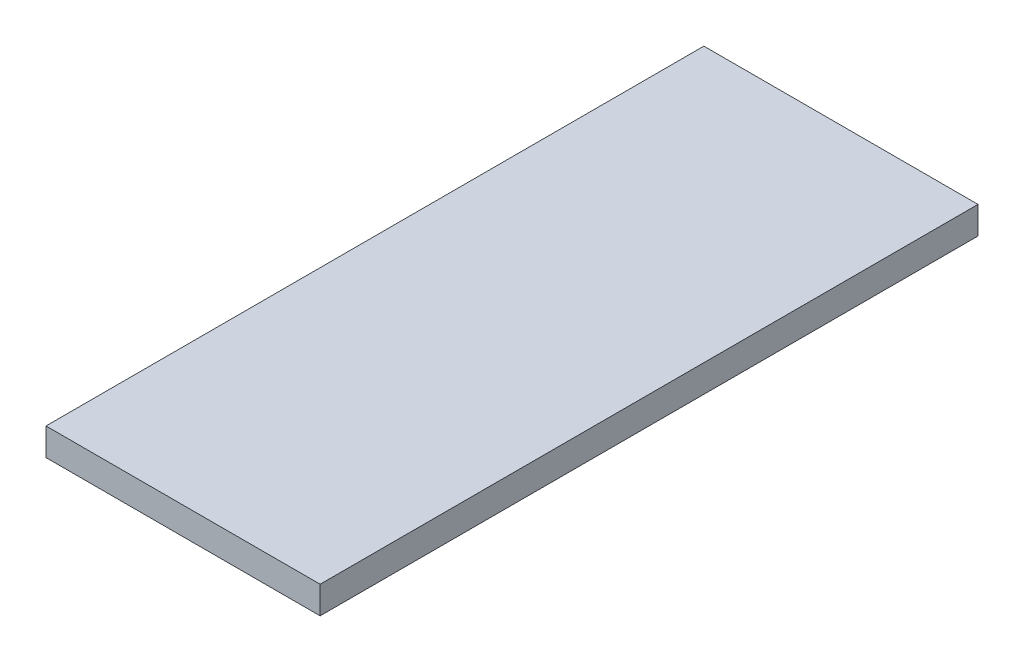
ISO-10303-21;
HEADER;
FILE_DESCRIPTION(('STEP AP214'),'2;1');
FILE_NAME('part.step','',(''),(''),'','','');
FILE_SCHEMA(('AUTOMOTIVE_DESIGN { 1 0 10303 214 1 1 1 1 }'));
ENDSEC;
DATA;
#1=APPLICATION_CONTEXT('core data for automotive mechanical design processes');
#2=APPLICATION_PROTOCOL_DEFINITION('international standard','automotive_design',2000,#1);
#3=PRODUCT_CONTEXT('',#1,'mechanical');
#4=PRODUCT('Part','Part','',(#3));
#5=PRODUCT_RELATED_PRODUCT_CATEGORY('part','',(#4));
#6=PRODUCT_DEFINITION_FORMATION('','',#4);
#7=PRODUCT_DEFINITION_CONTEXT('part definition',#1,'design');
#8=PRODUCT_DEFINITION('design','',#6,#7);
#9=PRODUCT_DEFINITION_SHAPE('','',#8);
#10=(LENGTH_UNIT() NAMED_UNIT(*) SI_UNIT(.MILLI.,.METRE.));
#11=(NAMED_UNIT(*) PLANE_ANGLE_UNIT() SI_UNIT($,.RADIAN.));
#12=(NAMED_UNIT(*) SI_UNIT($,.STERADIAN.) SOLID_ANGLE_UNIT());
#13=UNCERTAINTY_MEASURE_WITH_UNIT(LENGTH_MEASURE(1.E-05),#10,'distance_accuracy_value','');
#14=(GEOMETRIC_REPRESENTATION_CONTEXT(3) GLOBAL_UNCERTAINTY_ASSIGNED_CONTEXT((#13)) GLOBAL_UNIT_ASSIGNED_CONTEXT((#10,
#11,#12)) REPRESENTATION_CONTEXT('',''));
#15=CARTESIAN_POINT('',(0.,0.,0.));
#16=DIRECTION('',(0.,0.,1.));
#17=DIRECTION('',(1.,0.,0.));
#18=AXIS2_PLACEMENT_3D('',#15,#16,#17);
#19=CARTESIAN_POINT('',(0.,5.,0.));
#20=DIRECTION('',(1.,0.,0.));
#21=DIRECTION('',(0.,0.,-1.));
#22=AXIS2_PLACEMENT_3D('',#19,#20,#21);
#23=PLANE('',#22);
#24=DIRECTION('',(0.,0.,1.));
#25=VECTOR('',#24,1.);
#26=CARTESIAN_POINT('',(0.,0.,0.));
#27=LINE('',#26,#25);
#28=CARTESIAN_POINT('',(0.,0.,-120.));
#29=VERTEX_POINT('',#28);
#30=CARTESIAN_POINT('',(0.,0.,0.));
#31=VERTEX_POINT('',#30);
#32=EDGE_CURVE('E97',#29,#31,#27,.T.);
#33=ORIENTED_EDGE('',*,*,#32,.T.);
#34=DIRECTION('',(0.,-1.,0.));
#35=VECTOR('',#34,1.);
#36=CARTESIAN_POINT('',(0.,5.,0.));
#37=LINE('',#36,#35);
#38=CARTESIAN_POINT('',(0.,5.,0.));
#39=VERTEX_POINT('',#38);
#40=EDGE_CURVE('E11',#39,#31,#37,.T.);
#41=ORIENTED_EDGE('',*,*,#40,.F.);
#42=DIRECTION('',(0.,0.,1.));
#43=VECTOR('',#42,1.);
#44=CARTESIAN_POINT('',(0.,5.,0.));
#45=LINE('',#44,#43);
#46=CARTESIAN_POINT('',(0.,5.,-120.));
#47=VERTEX_POINT('',#46);
#48=EDGE_CURVE('E85',#47,#39,#45,.T.);
#49=ORIENTED_EDGE('',*,*,#48,.F.);
#50=DIRECTION('',(0.,-1.,0.));
#51=VECTOR('',#50,1.);
#52=CARTESIAN_POINT('',(0.,5.,-120.));
#53=LINE('',#52,#51);
#54=EDGE_CURVE('E93',#47,#29,#53,.T.);
#55=ORIENTED_EDGE('',*,*,#54,.T.);
#56=EDGE_LOOP('',(#33,#41,#49,#55));
#57=FACE_BOUND('',#56,.T.);
#58=ADVANCED_FACE('F34',(#57),#23,.F.);
#59=CARTESIAN_POINT('',(0.,5.,0.));
#60=DIRECTION('',(0.,0.,-1.));
#61=DIRECTION('',(-1.,0.,0.));
#62=AXIS2_PLACEMENT_3D('',#59,#60,#61);
#63=PLANE('',#62);
#64=DIRECTION('',(1.,0.,0.));
#65=VECTOR('',#64,1.);
#66=CARTESIAN_POINT('',(0.,0.,0.));
#67=LINE('',#66,#65);
#68=CARTESIAN_POINT('',(50.,0.,0.));
#69=VERTEX_POINT('',#68);
#70=EDGE_CURVE('E89',#31,#69,#67,.T.);
#71=ORIENTED_EDGE('',*,*,#70,.T.);
#72=DIRECTION('',(0.,-1.,0.));
#73=VECTOR('',#72,1.);
#74=CARTESIAN_POINT('',(50.,5.,0.));
#75=LINE('',#74,#73);
#76=CARTESIAN_POINT('',(50.,5.,0.));
#77=VERTEX_POINT('',#76);
#78=EDGE_CURVE('E42',#77,#69,#75,.T.);
#79=ORIENTED_EDGE('',*,*,#78,.F.);
#80=DIRECTION('',(1.,0.,0.));
#81=VECTOR('',#80,1.);
#82=CARTESIAN_POINT('',(0.,5.,0.));
#83=LINE('',#82,#81);
#84=EDGE_CURVE('E80',#39,#77,#83,.T.);
#85=ORIENTED_EDGE('',*,*,#84,.F.);
#86=ORIENTED_EDGE('',*,*,#40,.T.);
#87=EDGE_LOOP('',(#71,#79,#85,#86));
#88=FACE_BOUND('',#87,.T.);
#89=ADVANCED_FACE('F88',(#88),#63,.F.);
#90=CARTESIAN_POINT('',(50.,5.,0.));
#91=DIRECTION('',(-1.,0.,0.));
#92=DIRECTION('',(0.,0.,1.));
#93=AXIS2_PLACEMENT_3D('',#90,#91,#92);
#94=PLANE('',#93);
#95=DIRECTION('',(0.,0.,-1.));
#96=VECTOR('',#95,1.);
#97=CARTESIAN_POINT('',(50.,0.,0.));
#98=LINE('',#97,#96);
#99=CARTESIAN_POINT('',(50.,0.,-120.));
#100=VERTEX_POINT('',#99);
#101=EDGE_CURVE('E67',#69,#100,#98,.T.);
#102=ORIENTED_EDGE('',*,*,#101,.T.);
#103=DIRECTION('',(0.,-1.,0.));
#104=VECTOR('',#103,1.);
#105=CARTESIAN_POINT('',(50.,5.,-120.));
#106=LINE('',#105,#104);
#107=CARTESIAN_POINT('',(50.,5.,-120.));
#108=VERTEX_POINT('',#107);
#109=EDGE_CURVE('E90',#108,#100,#106,.T.);
#110=ORIENTED_EDGE('',*,*,#109,.F.);
#111=DIRECTION('',(0.,0.,-1.));
#112=VECTOR('',#111,1.);
#113=CARTESIAN_POINT('',(50.,5.,0.));
#114=LINE('',#113,#112);
#115=EDGE_CURVE('E83',#77,#108,#114,.T.);
#116=ORIENTED_EDGE('',*,*,#115,.F.);
#117=ORIENTED_EDGE('',*,*,#78,.T.);
#118=EDGE_LOOP('',(#102,#110,#116,#117));
#119=FACE_BOUND('',#118,.T.);
#120=ADVANCED_FACE('F91',(#119),#94,.F.);
#121=CARTESIAN_POINT('',(0.,5.,-120.));
#122=DIRECTION('',(0.,0.,1.));
#123=DIRECTION('',(1.,0.,0.));
#124=AXIS2_PLACEMENT_3D('',#121,#122,#123);
#125=PLANE('',#124);
#126=DIRECTION('',(-1.,0.,0.));
#127=VECTOR('',#126,1.);
#128=CARTESIAN_POINT('',(0.,0.,-120.));
#129=LINE('',#128,#127);
#130=EDGE_CURVE('E73',#100,#29,#129,.T.);
#131=ORIENTED_EDGE('',*,*,#130,.T.);
#132=ORIENTED_EDGE('',*,*,#54,.F.);
#133=DIRECTION('',(-1.,0.,0.));
#134=VECTOR('',#133,1.);
#135=CARTESIAN_POINT('',(0.,5.,-120.));
#136=LINE('',#135,#134);
#137=EDGE_CURVE('E50',#108,#47,#136,.T.);
#138=ORIENTED_EDGE('',*,*,#137,.F.);
#139=ORIENTED_EDGE('',*,*,#109,.T.);
#140=EDGE_LOOP('',(#131,#132,#138,#139));
#141=FACE_BOUND('',#140,.T.);
#142=ADVANCED_FACE('F104',(#141),#125,.F.);
#143=CARTESIAN_POINT('',(0.,5.,0.));
#144=DIRECTION('',(0.,-1.,0.));
#145=DIRECTION('',(0.,0.,-1.));
#146=AXIS2_PLACEMENT_3D('',#143,#144,#145);
#147=PLANE('',#146);
#148=ORIENTED_EDGE('',*,*,#48,.T.);
#149=ORIENTED_EDGE('',*,*,#84,.T.);
#150=ORIENTED_EDGE('',*,*,#115,.T.);
#151=ORIENTED_EDGE('',*,*,#137,.T.);
#152=EDGE_LOOP('',(#148,#149,#150,#151));
#153=FACE_BOUND('',#152,.T.);
#154=ADVANCED_FACE('F81',(#153),#147,.F.);
#155=CARTESIAN_POINT('',(0.,0.,0.));
#156=DIRECTION('',(0.,-1.,0.));
#157=DIRECTION('',(0.,0.,-1.));
#158=AXIS2_PLACEMENT_3D('',#155,#156,#157);
#159=PLANE('',#158);
#160=ORIENTED_EDGE('',*,*,#32,.F.);
#161=ORIENTED_EDGE('',*,*,#130,.F.);
#162=ORIENTED_EDGE('',*,*,#101,.F.);
#163=ORIENTED_EDGE('',*,*,#70,.F.);
#164=EDGE_LOOP('',(#160,#161,#162,#163));
#165=FACE_BOUND('',#164,.T.);
#166=ADVANCED_FACE('F107',(#165),#159,.T.);
#167=CLOSED_SHELL('',(#58,#89,#120,#142,#154,#166));
#168=MANIFOLD_SOLID_BREP('B2',#167);
#169=ADVANCED_BREP_SHAPE_REPRESENTATION('',(#18,#168),#14);
#170=SHAPE_DEFINITION_REPRESENTATION(#9,#169);
ENDSEC;
END-ISO-10303-21;
